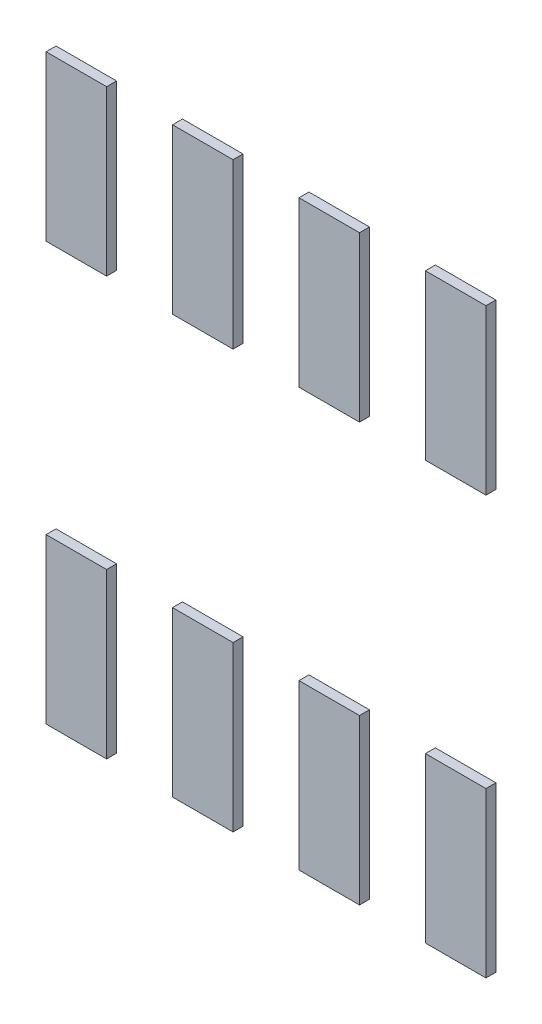
ISO-10303-21;
HEADER;
FILE_DESCRIPTION(('STEP AP214'),'2;1');
FILE_NAME('part.step','',(''),(''),'','','');
FILE_SCHEMA(('AUTOMOTIVE_DESIGN { 1 0 10303 214 1 1 1 1 }'));
ENDSEC;
DATA;
#1=APPLICATION_CONTEXT('core data for automotive mechanical design processes');
#2=APPLICATION_PROTOCOL_DEFINITION('international standard','automotive_design',2000,#1);
#3=PRODUCT_CONTEXT('',#1,'mechanical');
#4=PRODUCT('Part','Part','',(#3));
#5=PRODUCT_RELATED_PRODUCT_CATEGORY('part','',(#4));
#6=PRODUCT_DEFINITION_FORMATION('','',#4);
#7=PRODUCT_DEFINITION_CONTEXT('part definition',#1,'design');
#8=PRODUCT_DEFINITION('design','',#6,#7);
#9=PRODUCT_DEFINITION_SHAPE('','',#8);
#10=(LENGTH_UNIT() NAMED_UNIT(*) SI_UNIT(.MILLI.,.METRE.));
#11=(NAMED_UNIT(*) PLANE_ANGLE_UNIT() SI_UNIT($,.RADIAN.));
#12=(NAMED_UNIT(*) SI_UNIT($,.STERADIAN.) SOLID_ANGLE_UNIT());
#13=UNCERTAINTY_MEASURE_WITH_UNIT(LENGTH_MEASURE(1.E-05),#10,'distance_accuracy_value','');
#14=(GEOMETRIC_REPRESENTATION_CONTEXT(3) GLOBAL_UNCERTAINTY_ASSIGNED_CONTEXT((#13)) GLOBAL_UNIT_ASSIGNED_CONTEXT((#10,
#11,#12)) REPRESENTATION_CONTEXT('',''));
#15=CARTESIAN_POINT('',(0.,0.,0.));
#16=DIRECTION('',(0.,0.,1.));
#17=DIRECTION('',(1.,0.,0.));
#18=AXIS2_PLACEMENT_3D('',#15,#16,#17);
#19=CARTESIAN_POINT('',(-2.209,1.276,0.1));
#20=DIRECTION('',(0.,0.,1.));
#21=DIRECTION('',(1.,0.,0.));
#22=AXIS2_PLACEMENT_3D('',#19,#20,#21);
#23=PLANE('',#22);
#24=DIRECTION('',(0.,1.,0.));
#25=VECTOR('',#24,1.);
#26=CARTESIAN_POINT('',(-2.209,1.276,0.1));
#27=LINE('',#26,#25);
#28=CARTESIAN_POINT('',(-2.209,1.276,0.1));
#29=VERTEX_POINT('',#28);
#30=CARTESIAN_POINT('',(-2.209,2.924,0.1));
#31=VERTEX_POINT('',#30);
#32=EDGE_CURVE('P0_E88',#29,#31,#27,.T.);
#33=ORIENTED_EDGE('',*,*,#32,.F.);
#34=DIRECTION('',(1.,0.,0.));
#35=VECTOR('',#34,1.);
#36=CARTESIAN_POINT('',(-2.209,1.276,0.1));
#37=LINE('',#36,#35);
#38=CARTESIAN_POINT('',(-1.601,1.276,0.1));
#39=VERTEX_POINT('',#38);
#40=EDGE_CURVE('P0_E70',#29,#39,#37,.T.);
#41=ORIENTED_EDGE('',*,*,#40,.T.);
#42=DIRECTION('',(0.,1.,0.));
#43=VECTOR('',#42,1.);
#44=CARTESIAN_POINT('',(-1.601,1.276,0.1));
#45=LINE('',#44,#43);
#46=CARTESIAN_POINT('',(-1.601,2.924,0.1));
#47=VERTEX_POINT('',#46);
#48=EDGE_CURVE('P0_E82',#39,#47,#45,.T.);
#49=ORIENTED_EDGE('',*,*,#48,.T.);
#50=DIRECTION('',(1.,0.,0.));
#51=VECTOR('',#50,1.);
#52=CARTESIAN_POINT('',(-2.209,2.924,0.1));
#53=LINE('',#52,#51);
#54=EDGE_CURVE('P0_E11',#31,#47,#53,.T.);
#55=ORIENTED_EDGE('',*,*,#54,.F.);
#56=EDGE_LOOP('',(#33,#41,#49,#55));
#57=FACE_BOUND('',#56,.T.);
#58=ADVANCED_FACE('P0_F17',(#57),#23,.T.);
#59=CARTESIAN_POINT('',(-2.209,1.276,0.));
#60=DIRECTION('',(0.,0.,1.));
#61=DIRECTION('',(1.,0.,0.));
#62=AXIS2_PLACEMENT_3D('',#59,#60,#61);
#63=PLANE('',#62);
#64=DIRECTION('',(1.,0.,0.));
#65=VECTOR('',#64,1.);
#66=CARTESIAN_POINT('',(-2.209,2.924,0.));
#67=LINE('',#66,#65);
#68=CARTESIAN_POINT('',(-2.209,2.924,0.));
#69=VERTEX_POINT('',#68);
#70=CARTESIAN_POINT('',(-1.601,2.924,0.));
#71=VERTEX_POINT('',#70);
#72=EDGE_CURVE('P0_E25',#69,#71,#67,.T.);
#73=ORIENTED_EDGE('',*,*,#72,.T.);
#74=DIRECTION('',(0.,1.,0.));
#75=VECTOR('',#74,1.);
#76=CARTESIAN_POINT('',(-1.601,1.276,0.));
#77=LINE('',#76,#75);
#78=CARTESIAN_POINT('',(-1.601,1.276,0.));
#79=VERTEX_POINT('',#78);
#80=EDGE_CURVE('P0_E101',#79,#71,#77,.T.);
#81=ORIENTED_EDGE('',*,*,#80,.F.);
#82=DIRECTION('',(1.,0.,0.));
#83=VECTOR('',#82,1.);
#84=CARTESIAN_POINT('',(-2.209,1.276,0.));
#85=LINE('',#84,#83);
#86=CARTESIAN_POINT('',(-2.209,1.276,0.));
#87=VERTEX_POINT('',#86);
#88=EDGE_CURVE('P0_E81',#87,#79,#85,.T.);
#89=ORIENTED_EDGE('',*,*,#88,.F.);
#90=DIRECTION('',(0.,1.,0.));
#91=VECTOR('',#90,1.);
#92=CARTESIAN_POINT('',(-2.209,1.276,0.));
#93=LINE('',#92,#91);
#94=EDGE_CURVE('P0_E89',#87,#69,#93,.T.);
#95=ORIENTED_EDGE('',*,*,#94,.T.);
#96=EDGE_LOOP('',(#73,#81,#89,#95));
#97=FACE_BOUND('',#96,.T.);
#98=ADVANCED_FACE('P0_F150',(#97),#63,.F.);
#99=CARTESIAN_POINT('',(-2.209,2.924,0.));
#100=DIRECTION('',(0.,1.,0.));
#101=DIRECTION('',(1.,0.,0.));
#102=AXIS2_PLACEMENT_3D('',#99,#100,#101);
#103=PLANE('',#102);
#104=ORIENTED_EDGE('',*,*,#72,.F.);
#105=DIRECTION('',(0.,0.,1.));
#106=VECTOR('',#105,1.);
#107=CARTESIAN_POINT('',(-2.209,2.924,0.));
#108=LINE('',#107,#106);
#109=EDGE_CURVE('P0_E93',#69,#31,#108,.T.);
#110=ORIENTED_EDGE('',*,*,#109,.T.);
#111=ORIENTED_EDGE('',*,*,#54,.T.);
#112=DIRECTION('',(0.,0.,1.));
#113=VECTOR('',#112,1.);
#114=CARTESIAN_POINT('',(-1.601,2.924,0.));
#115=LINE('',#114,#113);
#116=EDGE_CURVE('P0_E105',#71,#47,#115,.T.);
#117=ORIENTED_EDGE('',*,*,#116,.F.);
#118=EDGE_LOOP('',(#104,#110,#111,#117));
#119=FACE_BOUND('',#118,.T.);
#120=ADVANCED_FACE('P0_F142',(#119),#103,.T.);
#121=CARTESIAN_POINT('',(-2.209,1.276,0.));
#122=DIRECTION('',(0.,1.,0.));
#123=DIRECTION('',(1.,0.,0.));
#124=AXIS2_PLACEMENT_3D('',#121,#122,#123);
#125=PLANE('',#124);
#126=DIRECTION('',(0.,0.,1.));
#127=VECTOR('',#126,1.);
#128=CARTESIAN_POINT('',(-1.601,1.276,0.));
#129=LINE('',#128,#127);
#130=EDGE_CURVE('P0_E76',#79,#39,#129,.T.);
#131=ORIENTED_EDGE('',*,*,#130,.T.);
#132=ORIENTED_EDGE('',*,*,#40,.F.);
#133=DIRECTION('',(0.,0.,1.));
#134=VECTOR('',#133,1.);
#135=CARTESIAN_POINT('',(-2.209,1.276,0.));
#136=LINE('',#135,#134);
#137=EDGE_CURVE('P0_E73',#87,#29,#136,.T.);
#138=ORIENTED_EDGE('',*,*,#137,.F.);
#139=ORIENTED_EDGE('',*,*,#88,.T.);
#140=EDGE_LOOP('',(#131,#132,#138,#139));
#141=FACE_BOUND('',#140,.T.);
#142=ADVANCED_FACE('P0_F72',(#141),#125,.F.);
#143=CARTESIAN_POINT('',(-1.601,1.276,0.));
#144=DIRECTION('',(1.,0.,0.));
#145=DIRECTION('',(0.,1.,0.));
#146=AXIS2_PLACEMENT_3D('',#143,#144,#145);
#147=PLANE('',#146);
#148=ORIENTED_EDGE('',*,*,#130,.F.);
#149=ORIENTED_EDGE('',*,*,#80,.T.);
#150=ORIENTED_EDGE('',*,*,#116,.T.);
#151=ORIENTED_EDGE('',*,*,#48,.F.);
#152=EDGE_LOOP('',(#148,#149,#150,#151));
#153=FACE_BOUND('',#152,.T.);
#154=ADVANCED_FACE('P0_F125',(#153),#147,.T.);
#155=CARTESIAN_POINT('',(-2.209,1.276,0.));
#156=DIRECTION('',(1.,0.,0.));
#157=DIRECTION('',(0.,1.,0.));
#158=AXIS2_PLACEMENT_3D('',#155,#156,#157);
#159=PLANE('',#158);
#160=ORIENTED_EDGE('',*,*,#32,.T.);
#161=ORIENTED_EDGE('',*,*,#109,.F.);
#162=ORIENTED_EDGE('',*,*,#94,.F.);
#163=ORIENTED_EDGE('',*,*,#137,.T.);
#164=EDGE_LOOP('',(#160,#161,#162,#163));
#165=FACE_BOUND('',#164,.T.);
#166=ADVANCED_FACE('P0_F86',(#165),#159,.F.);
#167=CLOSED_SHELL('',(#58,#98,#120,#142,#154,#166));
#168=MANIFOLD_SOLID_BREP('P0_B1',#167);
#169=CARTESIAN_POINT('',(-2.209,-2.924,0.1));
#170=DIRECTION('',(0.,0.,1.));
#171=DIRECTION('',(1.,0.,0.));
#172=AXIS2_PLACEMENT_3D('',#169,#170,#171);
#173=PLANE('',#172);
#174=DIRECTION('',(0.,1.,0.));
#175=VECTOR('',#174,1.);
#176=CARTESIAN_POINT('',(-2.209,-2.924,0.1));
#177=LINE('',#176,#175);
#178=CARTESIAN_POINT('',(-2.209,-2.924,0.1));
#179=VERTEX_POINT('',#178);
#180=CARTESIAN_POINT('',(-2.209,-1.276,0.1));
#181=VERTEX_POINT('',#180);
#182=EDGE_CURVE('P1_E88',#179,#181,#177,.T.);
#183=ORIENTED_EDGE('',*,*,#182,.F.);
#184=DIRECTION('',(1.,0.,0.));
#185=VECTOR('',#184,1.);
#186=CARTESIAN_POINT('',(-2.209,-2.924,0.1));
#187=LINE('',#186,#185);
#188=CARTESIAN_POINT('',(-1.601,-2.924,0.1));
#189=VERTEX_POINT('',#188);
#190=EDGE_CURVE('P1_E72',#179,#189,#187,.T.);
#191=ORIENTED_EDGE('',*,*,#190,.T.);
#192=DIRECTION('',(0.,1.,0.));
#193=VECTOR('',#192,1.);
#194=CARTESIAN_POINT('',(-1.601,-2.924,0.1));
#195=LINE('',#194,#193);
#196=CARTESIAN_POINT('',(-1.601,-1.276,0.1));
#197=VERTEX_POINT('',#196);
#198=EDGE_CURVE('P1_E83',#189,#197,#195,.T.);
#199=ORIENTED_EDGE('',*,*,#198,.T.);
#200=DIRECTION('',(1.,0.,0.));
#201=VECTOR('',#200,1.);
#202=CARTESIAN_POINT('',(-2.209,-1.276,0.1));
#203=LINE('',#202,#201);
#204=EDGE_CURVE('P1_E11',#181,#197,#203,.T.);
#205=ORIENTED_EDGE('',*,*,#204,.F.);
#206=EDGE_LOOP('',(#183,#191,#199,#205));
#207=FACE_BOUND('',#206,.T.);
#208=ADVANCED_FACE('P1_F17',(#207),#173,.T.);
#209=CARTESIAN_POINT('',(-2.209,-2.924,0.));
#210=DIRECTION('',(0.,0.,1.));
#211=DIRECTION('',(1.,0.,0.));
#212=AXIS2_PLACEMENT_3D('',#209,#210,#211);
#213=PLANE('',#212);
#214=DIRECTION('',(1.,0.,0.));
#215=VECTOR('',#214,1.);
#216=CARTESIAN_POINT('',(-2.209,-1.276,0.));
#217=LINE('',#216,#215);
#218=CARTESIAN_POINT('',(-2.209,-1.276,0.));
#219=VERTEX_POINT('',#218);
#220=CARTESIAN_POINT('',(-1.601,-1.276,0.));
#221=VERTEX_POINT('',#220);
#222=EDGE_CURVE('P1_E26',#219,#221,#217,.T.);
#223=ORIENTED_EDGE('',*,*,#222,.T.);
#224=DIRECTION('',(0.,1.,0.));
#225=VECTOR('',#224,1.);
#226=CARTESIAN_POINT('',(-1.601,-2.924,0.));
#227=LINE('',#226,#225);
#228=CARTESIAN_POINT('',(-1.601,-2.924,0.));
#229=VERTEX_POINT('',#228);
#230=EDGE_CURVE('P1_E105',#229,#221,#227,.T.);
#231=ORIENTED_EDGE('',*,*,#230,.F.);
#232=DIRECTION('',(1.,0.,0.));
#233=VECTOR('',#232,1.);
#234=CARTESIAN_POINT('',(-2.209,-2.924,0.));
#235=LINE('',#234,#233);
#236=CARTESIAN_POINT('',(-2.209,-2.924,0.));
#237=VERTEX_POINT('',#236);
#238=EDGE_CURVE('P1_E20',#237,#229,#235,.T.);
#239=ORIENTED_EDGE('',*,*,#238,.F.);
#240=DIRECTION('',(0.,1.,0.));
#241=VECTOR('',#240,1.);
#242=CARTESIAN_POINT('',(-2.209,-2.924,0.));
#243=LINE('',#242,#241);
#244=EDGE_CURVE('P1_E89',#237,#219,#243,.T.);
#245=ORIENTED_EDGE('',*,*,#244,.T.);
#246=EDGE_LOOP('',(#223,#231,#239,#245));
#247=FACE_BOUND('',#246,.T.);
#248=ADVANCED_FACE('P1_F118',(#247),#213,.F.);
#249=CARTESIAN_POINT('',(-2.209,-1.276,0.));
#250=DIRECTION('',(0.,1.,0.));
#251=DIRECTION('',(1.,0.,0.));
#252=AXIS2_PLACEMENT_3D('',#249,#250,#251);
#253=PLANE('',#252);
#254=ORIENTED_EDGE('',*,*,#222,.F.);
#255=DIRECTION('',(0.,0.,1.));
#256=VECTOR('',#255,1.);
#257=CARTESIAN_POINT('',(-2.209,-1.276,0.));
#258=LINE('',#257,#256);
#259=EDGE_CURVE('P1_E93',#219,#181,#258,.T.);
#260=ORIENTED_EDGE('',*,*,#259,.T.);
#261=ORIENTED_EDGE('',*,*,#204,.T.);
#262=DIRECTION('',(0.,0.,1.));
#263=VECTOR('',#262,1.);
#264=CARTESIAN_POINT('',(-1.601,-1.276,0.));
#265=LINE('',#264,#263);
#266=EDGE_CURVE('P1_E101',#221,#197,#265,.T.);
#267=ORIENTED_EDGE('',*,*,#266,.F.);
#268=EDGE_LOOP('',(#254,#260,#261,#267));
#269=FACE_BOUND('',#268,.T.);
#270=ADVANCED_FACE('P1_F117',(#269),#253,.T.);
#271=CARTESIAN_POINT('',(-2.209,-2.924,0.));
#272=DIRECTION('',(0.,1.,0.));
#273=DIRECTION('',(1.,0.,0.));
#274=AXIS2_PLACEMENT_3D('',#271,#272,#273);
#275=PLANE('',#274);
#276=DIRECTION('',(0.,0.,1.));
#277=VECTOR('',#276,1.);
#278=CARTESIAN_POINT('',(-1.601,-2.924,0.));
#279=LINE('',#278,#277);
#280=EDGE_CURVE('P1_E78',#229,#189,#279,.T.);
#281=ORIENTED_EDGE('',*,*,#280,.T.);
#282=ORIENTED_EDGE('',*,*,#190,.F.);
#283=DIRECTION('',(0.,0.,1.));
#284=VECTOR('',#283,1.);
#285=CARTESIAN_POINT('',(-2.209,-2.924,0.));
#286=LINE('',#285,#284);
#287=EDGE_CURVE('P1_E75',#237,#179,#286,.T.);
#288=ORIENTED_EDGE('',*,*,#287,.F.);
#289=ORIENTED_EDGE('',*,*,#238,.T.);
#290=EDGE_LOOP('',(#281,#282,#288,#289));
#291=FACE_BOUND('',#290,.T.);
#292=ADVANCED_FACE('P1_F74',(#291),#275,.F.);
#293=CARTESIAN_POINT('',(-1.601,-2.924,0.));
#294=DIRECTION('',(1.,0.,0.));
#295=DIRECTION('',(0.,1.,0.));
#296=AXIS2_PLACEMENT_3D('',#293,#294,#295);
#297=PLANE('',#296);
#298=ORIENTED_EDGE('',*,*,#280,.F.);
#299=ORIENTED_EDGE('',*,*,#230,.T.);
#300=ORIENTED_EDGE('',*,*,#266,.T.);
#301=ORIENTED_EDGE('',*,*,#198,.F.);
#302=EDGE_LOOP('',(#298,#299,#300,#301));
#303=FACE_BOUND('',#302,.T.);
#304=ADVANCED_FACE('P1_F116',(#303),#297,.T.);
#305=CARTESIAN_POINT('',(-2.209,-2.924,0.));
#306=DIRECTION('',(1.,0.,0.));
#307=DIRECTION('',(0.,1.,0.));
#308=AXIS2_PLACEMENT_3D('',#305,#306,#307);
#309=PLANE('',#308);
#310=ORIENTED_EDGE('',*,*,#182,.T.);
#311=ORIENTED_EDGE('',*,*,#259,.F.);
#312=ORIENTED_EDGE('',*,*,#244,.F.);
#313=ORIENTED_EDGE('',*,*,#287,.T.);
#314=EDGE_LOOP('',(#310,#311,#312,#313));
#315=FACE_BOUND('',#314,.T.);
#316=ADVANCED_FACE('P1_F86',(#315),#309,.F.);
#317=CLOSED_SHELL('',(#208,#248,#270,#292,#304,#316));
#318=MANIFOLD_SOLID_BREP('P1_B1',#317);
#319=CARTESIAN_POINT('',(-0.939,1.276,0.1));
#320=DIRECTION('',(0.,0.,1.));
#321=DIRECTION('',(1.,0.,0.));
#322=AXIS2_PLACEMENT_3D('',#319,#320,#321);
#323=PLANE('',#322);
#324=DIRECTION('',(0.,1.,0.));
#325=VECTOR('',#324,1.);
#326=CARTESIAN_POINT('',(-0.939,1.276,0.1));
#327=LINE('',#326,#325);
#328=CARTESIAN_POINT('',(-0.939,1.276,0.1));
#329=VERTEX_POINT('',#328);
#330=CARTESIAN_POINT('',(-0.939,2.924,0.1));
#331=VERTEX_POINT('',#330);
#332=EDGE_CURVE('P2_E114',#329,#331,#327,.T.);
#333=ORIENTED_EDGE('',*,*,#332,.F.);
#334=DIRECTION('',(1.,0.,0.));
#335=VECTOR('',#334,1.);
#336=CARTESIAN_POINT('',(-0.939,1.276,0.1));
#337=LINE('',#336,#335);
#338=CARTESIAN_POINT('',(-0.331,1.276,0.1));
#339=VERTEX_POINT('',#338);
#340=EDGE_CURVE('P2_E77',#329,#339,#337,.T.);
#341=ORIENTED_EDGE('',*,*,#340,.T.);
#342=DIRECTION('',(0.,1.,0.));
#343=VECTOR('',#342,1.);
#344=CARTESIAN_POINT('',(-0.331,1.276,0.1));
#345=LINE('',#344,#343);
#346=CARTESIAN_POINT('',(-0.331,2.924,0.1));
#347=VERTEX_POINT('',#346);
#348=EDGE_CURVE('P2_E89',#339,#347,#345,.T.);
#349=ORIENTED_EDGE('',*,*,#348,.T.);
#350=DIRECTION('',(1.,0.,0.));
#351=VECTOR('',#350,1.);
#352=CARTESIAN_POINT('',(-0.939,2.924,0.1));
#353=LINE('',#352,#351);
#354=EDGE_CURVE('P2_E11',#331,#347,#353,.T.);
#355=ORIENTED_EDGE('',*,*,#354,.F.);
#356=EDGE_LOOP('',(#333,#341,#349,#355));
#357=FACE_BOUND('',#356,.T.);
#358=ADVANCED_FACE('P2_F17',(#357),#323,.T.);
#359=CARTESIAN_POINT('',(-0.939,1.276,0.));
#360=DIRECTION('',(0.,0.,1.));
#361=DIRECTION('',(1.,0.,0.));
#362=AXIS2_PLACEMENT_3D('',#359,#360,#361);
#363=PLANE('',#362);
#364=DIRECTION('',(1.,0.,0.));
#365=VECTOR('',#364,1.);
#366=CARTESIAN_POINT('',(-0.939,2.924,0.));
#367=LINE('',#366,#365);
#368=CARTESIAN_POINT('',(-0.939,2.924,0.));
#369=VERTEX_POINT('',#368);
#370=CARTESIAN_POINT('',(-0.331,2.924,0.));
#371=VERTEX_POINT('',#370);
#372=EDGE_CURVE('P2_E25',#369,#371,#367,.T.);
#373=ORIENTED_EDGE('',*,*,#372,.T.);
#374=DIRECTION('',(0.,1.,0.));
#375=VECTOR('',#374,1.);
#376=CARTESIAN_POINT('',(-0.331,1.276,0.));
#377=LINE('',#376,#375);
#378=CARTESIAN_POINT('',(-0.331,1.276,0.));
#379=VERTEX_POINT('',#378);
#380=EDGE_CURVE('P2_E80',#379,#371,#377,.T.);
#381=ORIENTED_EDGE('',*,*,#380,.F.);
#382=DIRECTION('',(1.,0.,0.));
#383=VECTOR('',#382,1.);
#384=CARTESIAN_POINT('',(-0.939,1.276,0.));
#385=LINE('',#384,#383);
#386=CARTESIAN_POINT('',(-0.939,1.276,0.));
#387=VERTEX_POINT('',#386);
#388=EDGE_CURVE('P2_E68',#387,#379,#385,.T.);
#389=ORIENTED_EDGE('',*,*,#388,.F.);
#390=DIRECTION('',(0.,1.,0.));
#391=VECTOR('',#390,1.);
#392=CARTESIAN_POINT('',(-0.939,1.276,0.));
#393=LINE('',#392,#391);
#394=EDGE_CURVE('P2_E95',#387,#369,#393,.T.);
#395=ORIENTED_EDGE('',*,*,#394,.T.);
#396=EDGE_LOOP('',(#373,#381,#389,#395));
#397=FACE_BOUND('',#396,.T.);
#398=ADVANCED_FACE('P2_F81',(#397),#363,.F.);
#399=CARTESIAN_POINT('',(-0.939,2.924,0.));
#400=DIRECTION('',(0.,1.,0.));
#401=DIRECTION('',(1.,0.,0.));
#402=AXIS2_PLACEMENT_3D('',#399,#400,#401);
#403=PLANE('',#402);
#404=ORIENTED_EDGE('',*,*,#372,.F.);
#405=DIRECTION('',(0.,0.,1.));
#406=VECTOR('',#405,1.);
#407=CARTESIAN_POINT('',(-0.939,2.924,0.));
#408=LINE('',#407,#406);
#409=EDGE_CURVE('P2_E107',#369,#331,#408,.T.);
#410=ORIENTED_EDGE('',*,*,#409,.T.);
#411=ORIENTED_EDGE('',*,*,#354,.T.);
#412=DIRECTION('',(0.,0.,1.));
#413=VECTOR('',#412,1.);
#414=CARTESIAN_POINT('',(-0.331,2.924,0.));
#415=LINE('',#414,#413);
#416=EDGE_CURVE('P2_E85',#371,#347,#415,.T.);
#417=ORIENTED_EDGE('',*,*,#416,.F.);
#418=EDGE_LOOP('',(#404,#410,#411,#417));
#419=FACE_BOUND('',#418,.T.);
#420=ADVANCED_FACE('P2_F105',(#419),#403,.T.);
#421=CARTESIAN_POINT('',(-0.939,1.276,0.));
#422=DIRECTION('',(0.,1.,0.));
#423=DIRECTION('',(1.,0.,0.));
#424=AXIS2_PLACEMENT_3D('',#421,#422,#423);
#425=PLANE('',#424);
#426=DIRECTION('',(0.,0.,1.));
#427=VECTOR('',#426,1.);
#428=CARTESIAN_POINT('',(-0.331,1.276,0.));
#429=LINE('',#428,#427);
#430=EDGE_CURVE('P2_E72',#379,#339,#429,.T.);
#431=ORIENTED_EDGE('',*,*,#430,.T.);
#432=ORIENTED_EDGE('',*,*,#340,.F.);
#433=DIRECTION('',(0.,0.,1.));
#434=VECTOR('',#433,1.);
#435=CARTESIAN_POINT('',(-0.939,1.276,0.));
#436=LINE('',#435,#434);
#437=EDGE_CURVE('P2_E74',#387,#329,#436,.T.);
#438=ORIENTED_EDGE('',*,*,#437,.F.);
#439=ORIENTED_EDGE('',*,*,#388,.T.);
#440=EDGE_LOOP('',(#431,#432,#438,#439));
#441=FACE_BOUND('',#440,.T.);
#442=ADVANCED_FACE('P2_F69',(#441),#425,.F.);
#443=CARTESIAN_POINT('',(-0.331,1.276,0.));
#444=DIRECTION('',(1.,0.,0.));
#445=DIRECTION('',(0.,1.,0.));
#446=AXIS2_PLACEMENT_3D('',#443,#444,#445);
#447=PLANE('',#446);
#448=ORIENTED_EDGE('',*,*,#430,.F.);
#449=ORIENTED_EDGE('',*,*,#380,.T.);
#450=ORIENTED_EDGE('',*,*,#416,.T.);
#451=ORIENTED_EDGE('',*,*,#348,.F.);
#452=EDGE_LOOP('',(#448,#449,#450,#451));
#453=FACE_BOUND('',#452,.T.);
#454=ADVANCED_FACE('P2_F88',(#453),#447,.T.);
#455=CARTESIAN_POINT('',(-0.939,1.276,0.));
#456=DIRECTION('',(1.,0.,0.));
#457=DIRECTION('',(0.,1.,0.));
#458=AXIS2_PLACEMENT_3D('',#455,#456,#457);
#459=PLANE('',#458);
#460=ORIENTED_EDGE('',*,*,#332,.T.);
#461=ORIENTED_EDGE('',*,*,#409,.F.);
#462=ORIENTED_EDGE('',*,*,#394,.F.);
#463=ORIENTED_EDGE('',*,*,#437,.T.);
#464=EDGE_LOOP('',(#460,#461,#462,#463));
#465=FACE_BOUND('',#464,.T.);
#466=ADVANCED_FACE('P2_F113',(#465),#459,.F.);
#467=CLOSED_SHELL('',(#358,#398,#420,#442,#454,#466));
#468=MANIFOLD_SOLID_BREP('P2_B1',#467);
#469=CARTESIAN_POINT('',(-0.939,-2.924,0.1));
#470=DIRECTION('',(0.,0.,1.));
#471=DIRECTION('',(1.,0.,0.));
#472=AXIS2_PLACEMENT_3D('',#469,#470,#471);
#473=PLANE('',#472);
#474=DIRECTION('',(0.,1.,0.));
#475=VECTOR('',#474,1.);
#476=CARTESIAN_POINT('',(-0.939,-2.924,0.1));
#477=LINE('',#476,#475);
#478=CARTESIAN_POINT('',(-0.939,-2.924,0.1));
#479=VERTEX_POINT('',#478);
#480=CARTESIAN_POINT('',(-0.939,-1.276,0.1));
#481=VERTEX_POINT('',#480);
#482=EDGE_CURVE('P3_E93',#479,#481,#477,.T.);
#483=ORIENTED_EDGE('',*,*,#482,.F.);
#484=DIRECTION('',(1.,0.,0.));
#485=VECTOR('',#484,1.);
#486=CARTESIAN_POINT('',(-0.939,-2.924,0.1));
#487=LINE('',#486,#485);
#488=CARTESIAN_POINT('',(-0.331,-2.924,0.1));
#489=VERTEX_POINT('',#488);
#490=EDGE_CURVE('P3_E53',#479,#489,#487,.T.);
#491=ORIENTED_EDGE('',*,*,#490,.T.);
#492=DIRECTION('',(0.,1.,0.));
#493=VECTOR('',#492,1.);
#494=CARTESIAN_POINT('',(-0.331,-2.924,0.1));
#495=LINE('',#494,#493);
#496=CARTESIAN_POINT('',(-0.331,-1.276,0.1));
#497=VERTEX_POINT('',#496);
#498=EDGE_CURVE('P3_E101',#489,#497,#495,.T.);
#499=ORIENTED_EDGE('',*,*,#498,.T.);
#500=DIRECTION('',(1.,0.,0.));
#501=VECTOR('',#500,1.);
#502=CARTESIAN_POINT('',(-0.939,-1.276,0.1));
#503=LINE('',#502,#501);
#504=EDGE_CURVE('P3_E11',#481,#497,#503,.T.);
#505=ORIENTED_EDGE('',*,*,#504,.F.);
#506=EDGE_LOOP('',(#483,#491,#499,#505));
#507=FACE_BOUND('',#506,.T.);
#508=ADVANCED_FACE('P3_F17',(#507),#473,.T.);
#509=CARTESIAN_POINT('',(-0.939,-2.924,0.));
#510=DIRECTION('',(0.,0.,1.));
#511=DIRECTION('',(1.,0.,0.));
#512=AXIS2_PLACEMENT_3D('',#509,#510,#511);
#513=PLANE('',#512);
#514=DIRECTION('',(1.,0.,0.));
#515=VECTOR('',#514,1.);
#516=CARTESIAN_POINT('',(-0.939,-1.276,0.));
#517=LINE('',#516,#515);
#518=CARTESIAN_POINT('',(-0.939,-1.276,0.));
#519=VERTEX_POINT('',#518);
#520=CARTESIAN_POINT('',(-0.331,-1.276,0.));
#521=VERTEX_POINT('',#520);
#522=EDGE_CURVE('P3_E26',#519,#521,#517,.T.);
#523=ORIENTED_EDGE('',*,*,#522,.T.);
#524=DIRECTION('',(0.,1.,0.));
#525=VECTOR('',#524,1.);
#526=CARTESIAN_POINT('',(-0.331,-2.924,0.));
#527=LINE('',#526,#525);
#528=CARTESIAN_POINT('',(-0.331,-2.924,0.));
#529=VERTEX_POINT('',#528);
#530=EDGE_CURVE('P3_E110',#529,#521,#527,.T.);
#531=ORIENTED_EDGE('',*,*,#530,.F.);
#532=DIRECTION('',(1.,0.,0.));
#533=VECTOR('',#532,1.);
#534=CARTESIAN_POINT('',(-0.939,-2.924,0.));
#535=LINE('',#534,#533);
#536=CARTESIAN_POINT('',(-0.939,-2.924,0.));
#537=VERTEX_POINT('',#536);
#538=EDGE_CURVE('P3_E65',#537,#529,#535,.T.);
#539=ORIENTED_EDGE('',*,*,#538,.F.);
#540=DIRECTION('',(0.,1.,0.));
#541=VECTOR('',#540,1.);
#542=CARTESIAN_POINT('',(-0.939,-2.924,0.));
#543=LINE('',#542,#541);
#544=EDGE_CURVE('P3_E85',#537,#519,#543,.T.);
#545=ORIENTED_EDGE('',*,*,#544,.T.);
#546=EDGE_LOOP('',(#523,#531,#539,#545));
#547=FACE_BOUND('',#546,.T.);
#548=ADVANCED_FACE('P3_F86',(#547),#513,.F.);
#549=CARTESIAN_POINT('',(-0.939,-1.276,0.));
#550=DIRECTION('',(0.,1.,0.));
#551=DIRECTION('',(1.,0.,0.));
#552=AXIS2_PLACEMENT_3D('',#549,#550,#551);
#553=PLANE('',#552);
#554=ORIENTED_EDGE('',*,*,#522,.F.);
#555=DIRECTION('',(0.,0.,1.));
#556=VECTOR('',#555,1.);
#557=CARTESIAN_POINT('',(-0.939,-1.276,0.));
#558=LINE('',#557,#556);
#559=EDGE_CURVE('P3_E77',#519,#481,#558,.T.);
#560=ORIENTED_EDGE('',*,*,#559,.T.);
#561=ORIENTED_EDGE('',*,*,#504,.T.);
#562=DIRECTION('',(0.,0.,1.));
#563=VECTOR('',#562,1.);
#564=CARTESIAN_POINT('',(-0.331,-1.276,0.));
#565=LINE('',#564,#563);
#566=EDGE_CURVE('P3_E80',#521,#497,#565,.T.);
#567=ORIENTED_EDGE('',*,*,#566,.F.);
#568=EDGE_LOOP('',(#554,#560,#561,#567));
#569=FACE_BOUND('',#568,.T.);
#570=ADVANCED_FACE('P3_F75',(#569),#553,.T.);
#571=CARTESIAN_POINT('',(-0.939,-2.924,0.));
#572=DIRECTION('',(0.,1.,0.));
#573=DIRECTION('',(1.,0.,0.));
#574=AXIS2_PLACEMENT_3D('',#571,#572,#573);
#575=PLANE('',#574);
#576=DIRECTION('',(0.,0.,1.));
#577=VECTOR('',#576,1.);
#578=CARTESIAN_POINT('',(-0.331,-2.924,0.));
#579=LINE('',#578,#577);
#580=EDGE_CURVE('P3_E107',#529,#489,#579,.T.);
#581=ORIENTED_EDGE('',*,*,#580,.T.);
#582=ORIENTED_EDGE('',*,*,#490,.F.);
#583=DIRECTION('',(0.,0.,1.));
#584=VECTOR('',#583,1.);
#585=CARTESIAN_POINT('',(-0.939,-2.924,0.));
#586=LINE('',#585,#584);
#587=EDGE_CURVE('P3_E90',#537,#479,#586,.T.);
#588=ORIENTED_EDGE('',*,*,#587,.F.);
#589=ORIENTED_EDGE('',*,*,#538,.T.);
#590=EDGE_LOOP('',(#581,#582,#588,#589));
#591=FACE_BOUND('',#590,.T.);
#592=ADVANCED_FACE('P3_F136',(#591),#575,.F.);
#593=CARTESIAN_POINT('',(-0.331,-2.924,0.));
#594=DIRECTION('',(1.,0.,0.));
#595=DIRECTION('',(0.,1.,0.));
#596=AXIS2_PLACEMENT_3D('',#593,#594,#595);
#597=PLANE('',#596);
#598=ORIENTED_EDGE('',*,*,#580,.F.);
#599=ORIENTED_EDGE('',*,*,#530,.T.);
#600=ORIENTED_EDGE('',*,*,#566,.T.);
#601=ORIENTED_EDGE('',*,*,#498,.F.);
#602=EDGE_LOOP('',(#598,#599,#600,#601));
#603=FACE_BOUND('',#602,.T.);
#604=ADVANCED_FACE('P3_F127',(#603),#597,.T.);
#605=CARTESIAN_POINT('',(-0.939,-2.924,0.));
#606=DIRECTION('',(1.,0.,0.));
#607=DIRECTION('',(0.,1.,0.));
#608=AXIS2_PLACEMENT_3D('',#605,#606,#607);
#609=PLANE('',#608);
#610=ORIENTED_EDGE('',*,*,#482,.T.);
#611=ORIENTED_EDGE('',*,*,#559,.F.);
#612=ORIENTED_EDGE('',*,*,#544,.F.);
#613=ORIENTED_EDGE('',*,*,#587,.T.);
#614=EDGE_LOOP('',(#610,#611,#612,#613));
#615=FACE_BOUND('',#614,.T.);
#616=ADVANCED_FACE('P3_F92',(#615),#609,.F.);
#617=CLOSED_SHELL('',(#508,#548,#570,#592,#604,#616));
#618=MANIFOLD_SOLID_BREP('P3_B1',#617);
#619=CARTESIAN_POINT('',(0.331,1.276,0.1));
#620=DIRECTION('',(0.,0.,1.));
#621=DIRECTION('',(1.,0.,0.));
#622=AXIS2_PLACEMENT_3D('',#619,#620,#621);
#623=PLANE('',#622);
#624=DIRECTION('',(0.,1.,0.));
#625=VECTOR('',#624,1.);
#626=CARTESIAN_POINT('',(0.331,1.276,0.1));
#627=LINE('',#626,#625);
#628=CARTESIAN_POINT('',(0.331,1.276,0.1));
#629=VERTEX_POINT('',#628);
#630=CARTESIAN_POINT('',(0.331,2.924,0.1));
#631=VERTEX_POINT('',#630);
#632=EDGE_CURVE('P4_E97',#629,#631,#627,.T.);
#633=ORIENTED_EDGE('',*,*,#632,.F.);
#634=DIRECTION('',(1.,0.,0.));
#635=VECTOR('',#634,1.);
#636=CARTESIAN_POINT('',(0.331,1.276,0.1));
#637=LINE('',#636,#635);
#638=CARTESIAN_POINT('',(0.939,1.276,0.1));
#639=VERTEX_POINT('',#638);
#640=EDGE_CURVE('P4_E80',#629,#639,#637,.T.);
#641=ORIENTED_EDGE('',*,*,#640,.T.);
#642=DIRECTION('',(0.,1.,0.));
#643=VECTOR('',#642,1.);
#644=CARTESIAN_POINT('',(0.939,1.276,0.1));
#645=LINE('',#644,#643);
#646=CARTESIAN_POINT('',(0.939,2.924,0.1));
#647=VERTEX_POINT('',#646);
#648=EDGE_CURVE('P4_E108',#639,#647,#645,.T.);
#649=ORIENTED_EDGE('',*,*,#648,.T.);
#650=DIRECTION('',(1.,0.,0.));
#651=VECTOR('',#650,1.);
#652=CARTESIAN_POINT('',(0.331,2.924,0.1));
#653=LINE('',#652,#651);
#654=EDGE_CURVE('P4_E11',#631,#647,#653,.T.);
#655=ORIENTED_EDGE('',*,*,#654,.F.);
#656=EDGE_LOOP('',(#633,#641,#649,#655));
#657=FACE_BOUND('',#656,.T.);
#658=ADVANCED_FACE('P4_F17',(#657),#623,.T.);
#659=CARTESIAN_POINT('',(0.331,1.276,0.));
#660=DIRECTION('',(0.,0.,1.));
#661=DIRECTION('',(1.,0.,0.));
#662=AXIS2_PLACEMENT_3D('',#659,#660,#661);
#663=PLANE('',#662);
#664=DIRECTION('',(1.,0.,0.));
#665=VECTOR('',#664,1.);
#666=CARTESIAN_POINT('',(0.331,2.924,0.));
#667=LINE('',#666,#665);
#668=CARTESIAN_POINT('',(0.331,2.924,0.));
#669=VERTEX_POINT('',#668);
#670=CARTESIAN_POINT('',(0.939,2.924,0.));
#671=VERTEX_POINT('',#670);
#672=EDGE_CURVE('P4_E27',#669,#671,#667,.T.);
#673=ORIENTED_EDGE('',*,*,#672,.T.);
#674=DIRECTION('',(0.,1.,0.));
#675=VECTOR('',#674,1.);
#676=CARTESIAN_POINT('',(0.939,1.276,0.));
#677=LINE('',#676,#675);
#678=CARTESIAN_POINT('',(0.939,1.276,0.));
#679=VERTEX_POINT('',#678);
#680=EDGE_CURVE('P4_E75',#679,#671,#677,.T.);
#681=ORIENTED_EDGE('',*,*,#680,.F.);
#682=DIRECTION('',(1.,0.,0.));
#683=VECTOR('',#682,1.);
#684=CARTESIAN_POINT('',(0.331,1.276,0.));
#685=LINE('',#684,#683);
#686=CARTESIAN_POINT('',(0.331,1.276,0.));
#687=VERTEX_POINT('',#686);
#688=EDGE_CURVE('P4_E21',#687,#679,#685,.T.);
#689=ORIENTED_EDGE('',*,*,#688,.F.);
#690=DIRECTION('',(0.,1.,0.));
#691=VECTOR('',#690,1.);
#692=CARTESIAN_POINT('',(0.331,1.276,0.));
#693=LINE('',#692,#691);
#694=EDGE_CURVE('P4_E72',#687,#669,#693,.T.);
#695=ORIENTED_EDGE('',*,*,#694,.T.);
#696=EDGE_LOOP('',(#673,#681,#689,#695));
#697=FACE_BOUND('',#696,.T.);
#698=ADVANCED_FACE('P4_F19',(#697),#663,.F.);
#699=CARTESIAN_POINT('',(0.331,2.924,0.));
#700=DIRECTION('',(0.,1.,0.));
#701=DIRECTION('',(1.,0.,0.));
#702=AXIS2_PLACEMENT_3D('',#699,#700,#701);
#703=PLANE('',#702);
#704=ORIENTED_EDGE('',*,*,#672,.F.);
#705=DIRECTION('',(0.,0.,1.));
#706=VECTOR('',#705,1.);
#707=CARTESIAN_POINT('',(0.331,2.924,0.));
#708=LINE('',#707,#706);
#709=EDGE_CURVE('P4_E91',#669,#631,#708,.T.);
#710=ORIENTED_EDGE('',*,*,#709,.T.);
#711=ORIENTED_EDGE('',*,*,#654,.T.);
#712=DIRECTION('',(0.,0.,1.));
#713=VECTOR('',#712,1.);
#714=CARTESIAN_POINT('',(0.939,2.924,0.));
#715=LINE('',#714,#713);
#716=EDGE_CURVE('P4_E105',#671,#647,#715,.T.);
#717=ORIENTED_EDGE('',*,*,#716,.F.);
#718=EDGE_LOOP('',(#704,#710,#711,#717));
#719=FACE_BOUND('',#718,.T.);
#720=ADVANCED_FACE('P4_F117',(#719),#703,.T.);
#721=CARTESIAN_POINT('',(0.331,1.276,0.));
#722=DIRECTION('',(0.,1.,0.));
#723=DIRECTION('',(1.,0.,0.));
#724=AXIS2_PLACEMENT_3D('',#721,#722,#723);
#725=PLANE('',#724);
#726=DIRECTION('',(0.,0.,1.));
#727=VECTOR('',#726,1.);
#728=CARTESIAN_POINT('',(0.939,1.276,0.));
#729=LINE('',#728,#727);
#730=EDGE_CURVE('P4_E88',#679,#639,#729,.T.);
#731=ORIENTED_EDGE('',*,*,#730,.T.);
#732=ORIENTED_EDGE('',*,*,#640,.F.);
#733=DIRECTION('',(0.,0.,1.));
#734=VECTOR('',#733,1.);
#735=CARTESIAN_POINT('',(0.331,1.276,0.));
#736=LINE('',#735,#734);
#737=EDGE_CURVE('P4_E82',#687,#629,#736,.T.);
#738=ORIENTED_EDGE('',*,*,#737,.F.);
#739=ORIENTED_EDGE('',*,*,#688,.T.);
#740=EDGE_LOOP('',(#731,#732,#738,#739));
#741=FACE_BOUND('',#740,.T.);
#742=ADVANCED_FACE('P4_F83',(#741),#725,.F.);
#743=CARTESIAN_POINT('',(0.939,1.276,0.));
#744=DIRECTION('',(1.,0.,0.));
#745=DIRECTION('',(0.,1.,0.));
#746=AXIS2_PLACEMENT_3D('',#743,#744,#745);
#747=PLANE('',#746);
#748=ORIENTED_EDGE('',*,*,#730,.F.);
#749=ORIENTED_EDGE('',*,*,#680,.T.);
#750=ORIENTED_EDGE('',*,*,#716,.T.);
#751=ORIENTED_EDGE('',*,*,#648,.F.);
#752=EDGE_LOOP('',(#748,#749,#750,#751));
#753=FACE_BOUND('',#752,.T.);
#754=ADVANCED_FACE('P4_F116',(#753),#747,.T.);
#755=CARTESIAN_POINT('',(0.331,1.276,0.));
#756=DIRECTION('',(1.,0.,0.));
#757=DIRECTION('',(0.,1.,0.));
#758=AXIS2_PLACEMENT_3D('',#755,#756,#757);
#759=PLANE('',#758);
#760=ORIENTED_EDGE('',*,*,#632,.T.);
#761=ORIENTED_EDGE('',*,*,#709,.F.);
#762=ORIENTED_EDGE('',*,*,#694,.F.);
#763=ORIENTED_EDGE('',*,*,#737,.T.);
#764=EDGE_LOOP('',(#760,#761,#762,#763));
#765=FACE_BOUND('',#764,.T.);
#766=ADVANCED_FACE('P4_F90',(#765),#759,.F.);
#767=CLOSED_SHELL('',(#658,#698,#720,#742,#754,#766));
#768=MANIFOLD_SOLID_BREP('P4_B1',#767);
#769=CARTESIAN_POINT('',(0.331,-2.924,0.1));
#770=DIRECTION('',(0.,0.,1.));
#771=DIRECTION('',(1.,0.,0.));
#772=AXIS2_PLACEMENT_3D('',#769,#770,#771);
#773=PLANE('',#772);
#774=DIRECTION('',(0.,1.,0.));
#775=VECTOR('',#774,1.);
#776=CARTESIAN_POINT('',(0.331,-2.924,0.1));
#777=LINE('',#776,#775);
#778=CARTESIAN_POINT('',(0.331,-2.924,0.1));
#779=VERTEX_POINT('',#778);
#780=CARTESIAN_POINT('',(0.331,-1.276,0.1));
#781=VERTEX_POINT('',#780);
#782=EDGE_CURVE('P5_E69',#779,#781,#777,.T.);
#783=ORIENTED_EDGE('',*,*,#782,.F.);
#784=DIRECTION('',(1.,0.,0.));
#785=VECTOR('',#784,1.);
#786=CARTESIAN_POINT('',(0.331,-2.924,0.1));
#787=LINE('',#786,#785);
#788=CARTESIAN_POINT('',(0.939,-2.924,0.1));
#789=VERTEX_POINT('',#788);
#790=EDGE_CURVE('P5_E63',#779,#789,#787,.T.);
#791=ORIENTED_EDGE('',*,*,#790,.T.);
#792=DIRECTION('',(0.,1.,0.));
#793=VECTOR('',#792,1.);
#794=CARTESIAN_POINT('',(0.939,-2.924,0.1));
#795=LINE('',#794,#793);
#796=CARTESIAN_POINT('',(0.939,-1.276,0.1));
#797=VERTEX_POINT('',#796);
#798=EDGE_CURVE('P5_E65',#789,#797,#795,.T.);
#799=ORIENTED_EDGE('',*,*,#798,.T.);
#800=DIRECTION('',(1.,0.,0.));
#801=VECTOR('',#800,1.);
#802=CARTESIAN_POINT('',(0.331,-1.276,0.1));
#803=LINE('',#802,#801);
#804=EDGE_CURVE('P5_E11',#781,#797,#803,.T.);
#805=ORIENTED_EDGE('',*,*,#804,.F.);
#806=EDGE_LOOP('',(#783,#791,#799,#805));
#807=FACE_BOUND('',#806,.T.);
#808=ADVANCED_FACE('P5_F17',(#807),#773,.T.);
#809=CARTESIAN_POINT('',(0.331,-2.924,0.));
#810=DIRECTION('',(0.,0.,1.));
#811=DIRECTION('',(1.,0.,0.));
#812=AXIS2_PLACEMENT_3D('',#809,#810,#811);
#813=PLANE('',#812);
#814=DIRECTION('',(1.,0.,0.));
#815=VECTOR('',#814,1.);
#816=CARTESIAN_POINT('',(0.331,-1.276,0.));
#817=LINE('',#816,#815);
#818=CARTESIAN_POINT('',(0.331,-1.276,0.));
#819=VERTEX_POINT('',#818);
#820=CARTESIAN_POINT('',(0.939,-1.276,0.));
#821=VERTEX_POINT('',#820);
#822=EDGE_CURVE('P5_E21',#819,#821,#817,.T.);
#823=ORIENTED_EDGE('',*,*,#822,.T.);
#824=DIRECTION('',(0.,1.,0.));
#825=VECTOR('',#824,1.);
#826=CARTESIAN_POINT('',(0.939,-2.924,0.));
#827=LINE('',#826,#825);
#828=CARTESIAN_POINT('',(0.939,-2.924,0.));
#829=VERTEX_POINT('',#828);
#830=EDGE_CURVE('P5_E88',#829,#821,#827,.T.);
#831=ORIENTED_EDGE('',*,*,#830,.F.);
#832=DIRECTION('',(1.,0.,0.));
#833=VECTOR('',#832,1.);
#834=CARTESIAN_POINT('',(0.331,-2.924,0.));
#835=LINE('',#834,#833);
#836=CARTESIAN_POINT('',(0.331,-2.924,0.));
#837=VERTEX_POINT('',#836);
#838=EDGE_CURVE('P5_E75',#837,#829,#835,.T.);
#839=ORIENTED_EDGE('',*,*,#838,.F.);
#840=DIRECTION('',(0.,1.,0.));
#841=VECTOR('',#840,1.);
#842=CARTESIAN_POINT('',(0.331,-2.924,0.));
#843=LINE('',#842,#841);
#844=EDGE_CURVE('P5_E96',#837,#819,#843,.T.);
#845=ORIENTED_EDGE('',*,*,#844,.T.);
#846=EDGE_LOOP('',(#823,#831,#839,#845));
#847=FACE_BOUND('',#846,.T.);
#848=ADVANCED_FACE('P5_F19',(#847),#813,.F.);
#849=CARTESIAN_POINT('',(0.331,-1.276,0.));
#850=DIRECTION('',(0.,1.,0.));
#851=DIRECTION('',(1.,0.,0.));
#852=AXIS2_PLACEMENT_3D('',#849,#850,#851);
#853=PLANE('',#852);
#854=ORIENTED_EDGE('',*,*,#822,.F.);
#855=DIRECTION('',(0.,0.,1.));
#856=VECTOR('',#855,1.);
#857=CARTESIAN_POINT('',(0.331,-1.276,0.));
#858=LINE('',#857,#856);
#859=EDGE_CURVE('P5_E165',#819,#781,#858,.T.);
#860=ORIENTED_EDGE('',*,*,#859,.T.);
#861=ORIENTED_EDGE('',*,*,#804,.T.);
#862=DIRECTION('',(0.,0.,1.));
#863=VECTOR('',#862,1.);
#864=CARTESIAN_POINT('',(0.939,-1.276,0.));
#865=LINE('',#864,#863);
#866=EDGE_CURVE('P5_E82',#821,#797,#865,.T.);
#867=ORIENTED_EDGE('',*,*,#866,.F.);
#868=EDGE_LOOP('',(#854,#860,#861,#867));
#869=FACE_BOUND('',#868,.T.);
#870=ADVANCED_FACE('P5_F109',(#869),#853,.T.);
#871=CARTESIAN_POINT('',(0.331,-2.924,0.));
#872=DIRECTION('',(0.,1.,0.));
#873=DIRECTION('',(1.,0.,0.));
#874=AXIS2_PLACEMENT_3D('',#871,#872,#873);
#875=PLANE('',#874);
#876=DIRECTION('',(0.,0.,1.));
#877=VECTOR('',#876,1.);
#878=CARTESIAN_POINT('',(0.939,-2.924,0.));
#879=LINE('',#878,#877);
#880=EDGE_CURVE('P5_E81',#829,#789,#879,.T.);
#881=ORIENTED_EDGE('',*,*,#880,.T.);
#882=ORIENTED_EDGE('',*,*,#790,.F.);
#883=DIRECTION('',(0.,0.,1.));
#884=VECTOR('',#883,1.);
#885=CARTESIAN_POINT('',(0.331,-2.924,0.));
#886=LINE('',#885,#884);
#887=EDGE_CURVE('P5_E89',#837,#779,#886,.T.);
#888=ORIENTED_EDGE('',*,*,#887,.F.);
#889=ORIENTED_EDGE('',*,*,#838,.T.);
#890=EDGE_LOOP('',(#881,#882,#888,#889));
#891=FACE_BOUND('',#890,.T.);
#892=ADVANCED_FACE('P5_F85',(#891),#875,.F.);
#893=CARTESIAN_POINT('',(0.939,-2.924,0.));
#894=DIRECTION('',(1.,0.,0.));
#895=DIRECTION('',(0.,1.,0.));
#896=AXIS2_PLACEMENT_3D('',#893,#894,#895);
#897=PLANE('',#896);
#898=ORIENTED_EDGE('',*,*,#880,.F.);
#899=ORIENTED_EDGE('',*,*,#830,.T.);
#900=ORIENTED_EDGE('',*,*,#866,.T.);
#901=ORIENTED_EDGE('',*,*,#798,.F.);
#902=EDGE_LOOP('',(#898,#899,#900,#901));
#903=FACE_BOUND('',#902,.T.);
#904=ADVANCED_FACE('P5_F79',(#903),#897,.T.);
#905=CARTESIAN_POINT('',(0.331,-2.924,0.));
#906=DIRECTION('',(1.,0.,0.));
#907=DIRECTION('',(0.,1.,0.));
#908=AXIS2_PLACEMENT_3D('',#905,#906,#907);
#909=PLANE('',#908);
#910=ORIENTED_EDGE('',*,*,#782,.T.);
#911=ORIENTED_EDGE('',*,*,#859,.F.);
#912=ORIENTED_EDGE('',*,*,#844,.F.);
#913=ORIENTED_EDGE('',*,*,#887,.T.);
#914=EDGE_LOOP('',(#910,#911,#912,#913));
#915=FACE_BOUND('',#914,.T.);
#916=ADVANCED_FACE('P5_F152',(#915),#909,.F.);
#917=CLOSED_SHELL('',(#808,#848,#870,#892,#904,#916));
#918=MANIFOLD_SOLID_BREP('P5_B1',#917);
#919=CARTESIAN_POINT('',(1.601,1.276,0.1));
#920=DIRECTION('',(0.,0.,1.));
#921=DIRECTION('',(1.,0.,0.));
#922=AXIS2_PLACEMENT_3D('',#919,#920,#921);
#923=PLANE('',#922);
#924=DIRECTION('',(0.,1.,0.));
#925=VECTOR('',#924,1.);
#926=CARTESIAN_POINT('',(1.601,1.276,0.1));
#927=LINE('',#926,#925);
#928=CARTESIAN_POINT('',(1.601,1.276,0.1));
#929=VERTEX_POINT('',#928);
#930=CARTESIAN_POINT('',(1.601,2.924,0.1));
#931=VERTEX_POINT('',#930);
#932=EDGE_CURVE('P6_E88',#929,#931,#927,.T.);
#933=ORIENTED_EDGE('',*,*,#932,.F.);
#934=DIRECTION('',(1.,0.,0.));
#935=VECTOR('',#934,1.);
#936=CARTESIAN_POINT('',(1.601,1.276,0.1));
#937=LINE('',#936,#935);
#938=CARTESIAN_POINT('',(2.209,1.276,0.1));
#939=VERTEX_POINT('',#938);
#940=EDGE_CURVE('P6_E70',#929,#939,#937,.T.);
#941=ORIENTED_EDGE('',*,*,#940,.T.);
#942=DIRECTION('',(0.,1.,0.));
#943=VECTOR('',#942,1.);
#944=CARTESIAN_POINT('',(2.209,1.276,0.1));
#945=LINE('',#944,#943);
#946=CARTESIAN_POINT('',(2.209,2.924,0.1));
#947=VERTEX_POINT('',#946);
#948=EDGE_CURVE('P6_E82',#939,#947,#945,.T.);
#949=ORIENTED_EDGE('',*,*,#948,.T.);
#950=DIRECTION('',(1.,0.,0.));
#951=VECTOR('',#950,1.);
#952=CARTESIAN_POINT('',(1.601,2.924,0.1));
#953=LINE('',#952,#951);
#954=EDGE_CURVE('P6_E11',#931,#947,#953,.T.);
#955=ORIENTED_EDGE('',*,*,#954,.F.);
#956=EDGE_LOOP('',(#933,#941,#949,#955));
#957=FACE_BOUND('',#956,.T.);
#958=ADVANCED_FACE('P6_F17',(#957),#923,.T.);
#959=CARTESIAN_POINT('',(1.601,1.276,0.));
#960=DIRECTION('',(0.,0.,1.));
#961=DIRECTION('',(1.,0.,0.));
#962=AXIS2_PLACEMENT_3D('',#959,#960,#961);
#963=PLANE('',#962);
#964=DIRECTION('',(1.,0.,0.));
#965=VECTOR('',#964,1.);
#966=CARTESIAN_POINT('',(1.601,2.924,0.));
#967=LINE('',#966,#965);
#968=CARTESIAN_POINT('',(1.601,2.924,0.));
#969=VERTEX_POINT('',#968);
#970=CARTESIAN_POINT('',(2.209,2.924,0.));
#971=VERTEX_POINT('',#970);
#972=EDGE_CURVE('P6_E25',#969,#971,#967,.T.);
#973=ORIENTED_EDGE('',*,*,#972,.T.);
#974=DIRECTION('',(0.,1.,0.));
#975=VECTOR('',#974,1.);
#976=CARTESIAN_POINT('',(2.209,1.276,0.));
#977=LINE('',#976,#975);
#978=CARTESIAN_POINT('',(2.209,1.276,0.));
#979=VERTEX_POINT('',#978);
#980=EDGE_CURVE('P6_E103',#979,#971,#977,.T.);
#981=ORIENTED_EDGE('',*,*,#980,.F.);
#982=DIRECTION('',(1.,0.,0.));
#983=VECTOR('',#982,1.);
#984=CARTESIAN_POINT('',(1.601,1.276,0.));
#985=LINE('',#984,#983);
#986=CARTESIAN_POINT('',(1.601,1.276,0.));
#987=VERTEX_POINT('',#986);
#988=EDGE_CURVE('P6_E81',#987,#979,#985,.T.);
#989=ORIENTED_EDGE('',*,*,#988,.F.);
#990=DIRECTION('',(0.,1.,0.));
#991=VECTOR('',#990,1.);
#992=CARTESIAN_POINT('',(1.601,1.276,0.));
#993=LINE('',#992,#991);
#994=EDGE_CURVE('P6_E89',#987,#969,#993,.T.);
#995=ORIENTED_EDGE('',*,*,#994,.T.);
#996=EDGE_LOOP('',(#973,#981,#989,#995));
#997=FACE_BOUND('',#996,.T.);
#998=ADVANCED_FACE('P6_F116',(#997),#963,.F.);
#999=CARTESIAN_POINT('',(1.601,2.924,0.));
#1000=DIRECTION('',(0.,1.,0.));
#1001=DIRECTION('',(1.,0.,0.));
#1002=AXIS2_PLACEMENT_3D('',#999,#1000,#1001);
#1003=PLANE('',#1002);
#1004=ORIENTED_EDGE('',*,*,#972,.F.);
#1005=DIRECTION('',(0.,0.,1.));
#1006=VECTOR('',#1005,1.);
#1007=CARTESIAN_POINT('',(1.601,2.924,0.));
#1008=LINE('',#1007,#1006);
#1009=EDGE_CURVE('P6_E93',#969,#931,#1008,.T.);
#1010=ORIENTED_EDGE('',*,*,#1009,.T.);
#1011=ORIENTED_EDGE('',*,*,#954,.T.);
#1012=DIRECTION('',(0.,0.,1.));
#1013=VECTOR('',#1012,1.);
#1014=CARTESIAN_POINT('',(2.209,2.924,0.));
#1015=LINE('',#1014,#1013);
#1016=EDGE_CURVE('P6_E107',#971,#947,#1015,.T.);
#1017=ORIENTED_EDGE('',*,*,#1016,.F.);
#1018=EDGE_LOOP('',(#1004,#1010,#1011,#1017));
#1019=FACE_BOUND('',#1018,.T.);
#1020=ADVANCED_FACE('P6_F119',(#1019),#1003,.T.);
#1021=CARTESIAN_POINT('',(1.601,1.276,0.));
#1022=DIRECTION('',(0.,1.,0.));
#1023=DIRECTION('',(1.,0.,0.));
#1024=AXIS2_PLACEMENT_3D('',#1021,#1022,#1023);
#1025=PLANE('',#1024);
#1026=DIRECTION('',(0.,0.,1.));
#1027=VECTOR('',#1026,1.);
#1028=CARTESIAN_POINT('',(2.209,1.276,0.));
#1029=LINE('',#1028,#1027);
#1030=EDGE_CURVE('P6_E76',#979,#939,#1029,.T.);
#1031=ORIENTED_EDGE('',*,*,#1030,.T.);
#1032=ORIENTED_EDGE('',*,*,#940,.F.);
#1033=DIRECTION('',(0.,0.,1.));
#1034=VECTOR('',#1033,1.);
#1035=CARTESIAN_POINT('',(1.601,1.276,0.));
#1036=LINE('',#1035,#1034);
#1037=EDGE_CURVE('P6_E73',#987,#929,#1036,.T.);
#1038=ORIENTED_EDGE('',*,*,#1037,.F.);
#1039=ORIENTED_EDGE('',*,*,#988,.T.);
#1040=EDGE_LOOP('',(#1031,#1032,#1038,#1039));
#1041=FACE_BOUND('',#1040,.T.);
#1042=ADVANCED_FACE('P6_F72',(#1041),#1025,.F.);
#1043=CARTESIAN_POINT('',(2.209,1.276,0.));
#1044=DIRECTION('',(1.,0.,0.));
#1045=DIRECTION('',(0.,1.,0.));
#1046=AXIS2_PLACEMENT_3D('',#1043,#1044,#1045);
#1047=PLANE('',#1046);
#1048=ORIENTED_EDGE('',*,*,#1030,.F.);
#1049=ORIENTED_EDGE('',*,*,#980,.T.);
#1050=ORIENTED_EDGE('',*,*,#1016,.T.);
#1051=ORIENTED_EDGE('',*,*,#948,.F.);
#1052=EDGE_LOOP('',(#1048,#1049,#1050,#1051));
#1053=FACE_BOUND('',#1052,.T.);
#1054=ADVANCED_FACE('P6_F118',(#1053),#1047,.T.);
#1055=CARTESIAN_POINT('',(1.601,1.276,0.));
#1056=DIRECTION('',(1.,0.,0.));
#1057=DIRECTION('',(0.,1.,0.));
#1058=AXIS2_PLACEMENT_3D('',#1055,#1056,#1057);
#1059=PLANE('',#1058);
#1060=ORIENTED_EDGE('',*,*,#932,.T.);
#1061=ORIENTED_EDGE('',*,*,#1009,.F.);
#1062=ORIENTED_EDGE('',*,*,#994,.F.);
#1063=ORIENTED_EDGE('',*,*,#1037,.T.);
#1064=EDGE_LOOP('',(#1060,#1061,#1062,#1063));
#1065=FACE_BOUND('',#1064,.T.);
#1066=ADVANCED_FACE('P6_F86',(#1065),#1059,.F.);
#1067=CLOSED_SHELL('',(#958,#998,#1020,#1042,#1054,#1066));
#1068=MANIFOLD_SOLID_BREP('P6_B1',#1067);
#1069=CARTESIAN_POINT('',(1.601,-2.924,0.1));
#1070=DIRECTION('',(0.,0.,1.));
#1071=DIRECTION('',(1.,0.,0.));
#1072=AXIS2_PLACEMENT_3D('',#1069,#1070,#1071);
#1073=PLANE('',#1072);
#1074=DIRECTION('',(0.,1.,0.));
#1075=VECTOR('',#1074,1.);
#1076=CARTESIAN_POINT('',(1.601,-2.924,0.1));
#1077=LINE('',#1076,#1075);
#1078=CARTESIAN_POINT('',(1.601,-2.924,0.1));
#1079=VERTEX_POINT('',#1078);
#1080=CARTESIAN_POINT('',(1.601,-1.276,0.1));
#1081=VERTEX_POINT('',#1080);
#1082=EDGE_CURVE('P7_E96',#1079,#1081,#1077,.T.);
#1083=ORIENTED_EDGE('',*,*,#1082,.F.);
#1084=DIRECTION('',(1.,0.,0.));
#1085=VECTOR('',#1084,1.);
#1086=CARTESIAN_POINT('',(1.601,-2.924,0.1));
#1087=LINE('',#1086,#1085);
#1088=CARTESIAN_POINT('',(2.209,-2.924,0.1));
#1089=VERTEX_POINT('',#1088);
#1090=EDGE_CURVE('P7_E76',#1079,#1089,#1087,.T.);
#1091=ORIENTED_EDGE('',*,*,#1090,.T.);
#1092=DIRECTION('',(0.,1.,0.));
#1093=VECTOR('',#1092,1.);
#1094=CARTESIAN_POINT('',(2.209,-2.924,0.1));
#1095=LINE('',#1094,#1093);
#1096=CARTESIAN_POINT('',(2.209,-1.276,0.1));
#1097=VERTEX_POINT('',#1096);
#1098=EDGE_CURVE('P7_E87',#1089,#1097,#1095,.T.);
#1099=ORIENTED_EDGE('',*,*,#1098,.T.);
#1100=DIRECTION('',(1.,0.,0.));
#1101=VECTOR('',#1100,1.);
#1102=CARTESIAN_POINT('',(1.601,-1.276,0.1));
#1103=LINE('',#1102,#1101);
#1104=EDGE_CURVE('P7_E11',#1081,#1097,#1103,.T.);
#1105=ORIENTED_EDGE('',*,*,#1104,.F.);
#1106=EDGE_LOOP('',(#1083,#1091,#1099,#1105));
#1107=FACE_BOUND('',#1106,.T.);
#1108=ADVANCED_FACE('P7_F17',(#1107),#1073,.T.);
#1109=CARTESIAN_POINT('',(1.601,-2.924,0.));
#1110=DIRECTION('',(0.,0.,1.));
#1111=DIRECTION('',(1.,0.,0.));
#1112=AXIS2_PLACEMENT_3D('',#1109,#1110,#1111);
#1113=PLANE('',#1112);
#1114=DIRECTION('',(1.,0.,0.));
#1115=VECTOR('',#1114,1.);
#1116=CARTESIAN_POINT('',(1.601,-1.276,0.));
#1117=LINE('',#1116,#1115);
#1118=CARTESIAN_POINT('',(1.601,-1.276,0.));
#1119=VERTEX_POINT('',#1118);
#1120=CARTESIAN_POINT('',(2.209,-1.276,0.));
#1121=VERTEX_POINT('',#1120);
#1122=EDGE_CURVE('P7_E26',#1119,#1121,#1117,.T.);
#1123=ORIENTED_EDGE('',*,*,#1122,.T.);
#1124=DIRECTION('',(0.,1.,0.));
#1125=VECTOR('',#1124,1.);
#1126=CARTESIAN_POINT('',(2.209,-2.924,0.));
#1127=LINE('',#1126,#1125);
#1128=CARTESIAN_POINT('',(2.209,-2.924,0.));
#1129=VERTEX_POINT('',#1128);
#1130=EDGE_CURVE('P7_E79',#1129,#1121,#1127,.T.);
#1131=ORIENTED_EDGE('',*,*,#1130,.F.);
#1132=DIRECTION('',(1.,0.,0.));
#1133=VECTOR('',#1132,1.);
#1134=CARTESIAN_POINT('',(1.601,-2.924,0.));
#1135=LINE('',#1134,#1133);
#1136=CARTESIAN_POINT('',(1.601,-2.924,0.));
#1137=VERTEX_POINT('',#1136);
#1138=EDGE_CURVE('P7_E67',#1137,#1129,#1135,.T.);
#1139=ORIENTED_EDGE('',*,*,#1138,.F.);
#1140=DIRECTION('',(0.,1.,0.));
#1141=VECTOR('',#1140,1.);
#1142=CARTESIAN_POINT('',(1.601,-2.924,0.));
#1143=LINE('',#1142,#1141);
#1144=EDGE_CURVE('P7_E93',#1137,#1119,#1143,.T.);
#1145=ORIENTED_EDGE('',*,*,#1144,.T.);
#1146=EDGE_LOOP('',(#1123,#1131,#1139,#1145));
#1147=FACE_BOUND('',#1146,.T.);
#1148=ADVANCED_FACE('P7_F19',(#1147),#1113,.F.);
#1149=CARTESIAN_POINT('',(1.601,-1.276,0.));
#1150=DIRECTION('',(0.,1.,0.));
#1151=DIRECTION('',(1.,0.,0.));
#1152=AXIS2_PLACEMENT_3D('',#1149,#1150,#1151);
#1153=PLANE('',#1152);
#1154=ORIENTED_EDGE('',*,*,#1122,.F.);
#1155=DIRECTION('',(0.,0.,1.));
#1156=VECTOR('',#1155,1.);
#1157=CARTESIAN_POINT('',(1.601,-1.276,0.));
#1158=LINE('',#1157,#1156);
#1159=EDGE_CURVE('P7_E99',#1119,#1081,#1158,.T.);
#1160=ORIENTED_EDGE('',*,*,#1159,.T.);
#1161=ORIENTED_EDGE('',*,*,#1104,.T.);
#1162=DIRECTION('',(0.,0.,1.));
#1163=VECTOR('',#1162,1.);
#1164=CARTESIAN_POINT('',(2.209,-1.276,0.));
#1165=LINE('',#1164,#1163);
#1166=EDGE_CURVE('P7_E83',#1121,#1097,#1165,.T.);
#1167=ORIENTED_EDGE('',*,*,#1166,.F.);
#1168=EDGE_LOOP('',(#1154,#1160,#1161,#1167));
#1169=FACE_BOUND('',#1168,.T.);
#1170=ADVANCED_FACE('P7_F116',(#1169),#1153,.T.);
#1171=CARTESIAN_POINT('',(1.601,-2.924,0.));
#1172=DIRECTION('',(0.,1.,0.));
#1173=DIRECTION('',(1.,0.,0.));
#1174=AXIS2_PLACEMENT_3D('',#1171,#1172,#1173);
#1175=PLANE('',#1174);
#1176=DIRECTION('',(0.,0.,1.));
#1177=VECTOR('',#1176,1.);
#1178=CARTESIAN_POINT('',(2.209,-2.924,0.));
#1179=LINE('',#1178,#1177);
#1180=EDGE_CURVE('P7_E71',#1129,#1089,#1179,.T.);
#1181=ORIENTED_EDGE('',*,*,#1180,.T.);
#1182=ORIENTED_EDGE('',*,*,#1090,.F.);
#1183=DIRECTION('',(0.,0.,1.));
#1184=VECTOR('',#1183,1.);
#1185=CARTESIAN_POINT('',(1.601,-2.924,0.));
#1186=LINE('',#1185,#1184);
#1187=EDGE_CURVE('P7_E73',#1137,#1079,#1186,.T.);
#1188=ORIENTED_EDGE('',*,*,#1187,.F.);
#1189=ORIENTED_EDGE('',*,*,#1138,.T.);
#1190=EDGE_LOOP('',(#1181,#1182,#1188,#1189));
#1191=FACE_BOUND('',#1190,.T.);
#1192=ADVANCED_FACE('P7_F68',(#1191),#1175,.F.);
#1193=CARTESIAN_POINT('',(2.209,-2.924,0.));
#1194=DIRECTION('',(1.,0.,0.));
#1195=DIRECTION('',(0.,1.,0.));
#1196=AXIS2_PLACEMENT_3D('',#1193,#1194,#1195);
#1197=PLANE('',#1196);
#1198=ORIENTED_EDGE('',*,*,#1180,.F.);
#1199=ORIENTED_EDGE('',*,*,#1130,.T.);
#1200=ORIENTED_EDGE('',*,*,#1166,.T.);
#1201=ORIENTED_EDGE('',*,*,#1098,.F.);
#1202=EDGE_LOOP('',(#1198,#1199,#1200,#1201));
#1203=FACE_BOUND('',#1202,.T.);
#1204=ADVANCED_FACE('P7_F86',(#1203),#1197,.T.);
#1205=CARTESIAN_POINT('',(1.601,-2.924,0.));
#1206=DIRECTION('',(1.,0.,0.));
#1207=DIRECTION('',(0.,1.,0.));
#1208=AXIS2_PLACEMENT_3D('',#1205,#1206,#1207);
#1209=PLANE('',#1208);
#1210=ORIENTED_EDGE('',*,*,#1082,.T.);
#1211=ORIENTED_EDGE('',*,*,#1159,.F.);
#1212=ORIENTED_EDGE('',*,*,#1144,.F.);
#1213=ORIENTED_EDGE('',*,*,#1187,.T.);
#1214=EDGE_LOOP('',(#1210,#1211,#1212,#1213));
#1215=FACE_BOUND('',#1214,.T.);
#1216=ADVANCED_FACE('P7_F127',(#1215),#1209,.F.);
#1217=CLOSED_SHELL('',(#1108,#1148,#1170,#1192,#1204,#1216));
#1218=MANIFOLD_SOLID_BREP('P7_B1',#1217);
#1219=ADVANCED_BREP_SHAPE_REPRESENTATION('',(#18,#168,#318,#468,#618,#768,#918,#1068,#1218),#14);
#1220=SHAPE_DEFINITION_REPRESENTATION(#9,#1219);
ENDSEC;
END-ISO-10303-21;
